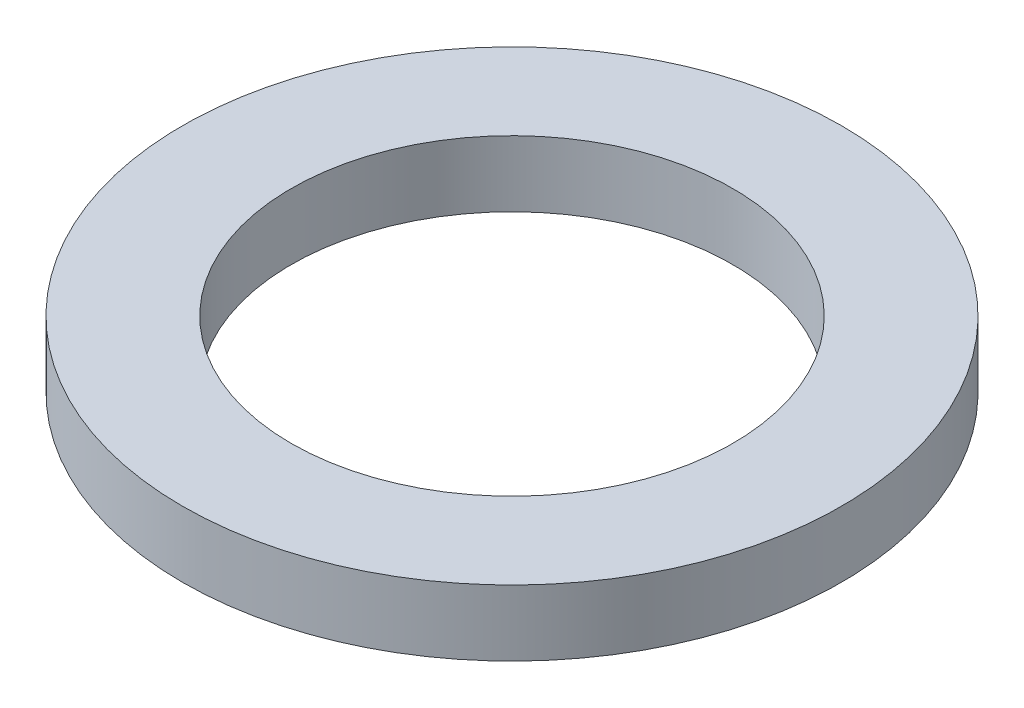
ISO-10303-21;
HEADER;
FILE_DESCRIPTION(('STEP AP214'),'2;1');
FILE_NAME('part.step','',(''),(''),'','','');
FILE_SCHEMA(('AUTOMOTIVE_DESIGN { 1 0 10303 214 1 1 1 1 }'));
ENDSEC;
DATA;
#1=APPLICATION_CONTEXT('core data for automotive mechanical design processes');
#2=APPLICATION_PROTOCOL_DEFINITION('international standard','automotive_design',2000,#1);
#3=PRODUCT_CONTEXT('',#1,'mechanical');
#4=PRODUCT('Part','Part','',(#3));
#5=PRODUCT_RELATED_PRODUCT_CATEGORY('part','',(#4));
#6=PRODUCT_DEFINITION_FORMATION('','',#4);
#7=PRODUCT_DEFINITION_CONTEXT('part definition',#1,'design');
#8=PRODUCT_DEFINITION('design','',#6,#7);
#9=PRODUCT_DEFINITION_SHAPE('','',#8);
#10=(LENGTH_UNIT() NAMED_UNIT(*) SI_UNIT(.MILLI.,.METRE.));
#11=(NAMED_UNIT(*) PLANE_ANGLE_UNIT() SI_UNIT($,.RADIAN.));
#12=(NAMED_UNIT(*) SI_UNIT($,.STERADIAN.) SOLID_ANGLE_UNIT());
#13=UNCERTAINTY_MEASURE_WITH_UNIT(LENGTH_MEASURE(1.E-05),#10,'distance_accuracy_value','');
#14=(GEOMETRIC_REPRESENTATION_CONTEXT(3) GLOBAL_UNCERTAINTY_ASSIGNED_CONTEXT((#13)) GLOBAL_UNIT_ASSIGNED_CONTEXT((#10,
#11,#12)) REPRESENTATION_CONTEXT('',''));
#15=CARTESIAN_POINT('',(0.,0.,0.));
#16=DIRECTION('',(0.,0.,1.));
#17=DIRECTION('',(1.,0.,0.));
#18=AXIS2_PLACEMENT_3D('',#15,#16,#17);
#19=CARTESIAN_POINT('',(0.,1.,0.));
#20=DIRECTION('',(0.,1.,0.));
#21=DIRECTION('',(0.,0.,1.));
#22=AXIS2_PLACEMENT_3D('',#19,#20,#21);
#23=PLANE('',#22);
#24=CARTESIAN_POINT('',(0.,1.,0.));
#25=DIRECTION('',(0.,1.,0.));
#26=DIRECTION('',(0.,0.,1.));
#27=AXIS2_PLACEMENT_3D('',#24,#25,#26);
#28=CIRCLE('',#27,5.);
#29=CARTESIAN_POINT('',(0.,1.,5.));
#30=VERTEX_POINT('',#29);
#31=EDGE_CURVE('E10',#30,#30,#28,.T.);
#32=ORIENTED_EDGE('',*,*,#31,.T.);
#33=EDGE_LOOP('',(#32));
#34=FACE_BOUND('',#33,.T.);
#35=CARTESIAN_POINT('',(0.,1.,0.));
#36=DIRECTION('',(0.,1.,0.));
#37=DIRECTION('',(0.,0.,1.));
#38=AXIS2_PLACEMENT_3D('',#35,#36,#37);
#39=CIRCLE('',#38,3.35);
#40=CARTESIAN_POINT('',(0.,1.,3.35));
#41=VERTEX_POINT('',#40);
#42=EDGE_CURVE('E43',#41,#41,#39,.T.);
#43=ORIENTED_EDGE('',*,*,#42,.F.);
#44=EDGE_LOOP('',(#43));
#45=FACE_BOUND('',#44,.T.);
#46=ADVANCED_FACE('F32',(#34,#45),#23,.T.);
#47=CARTESIAN_POINT('',(0.,0.,0.));
#48=DIRECTION('',(0.,1.,0.));
#49=DIRECTION('',(0.,0.,1.));
#50=AXIS2_PLACEMENT_3D('',#47,#48,#49);
#51=PLANE('',#50);
#52=CARTESIAN_POINT('',(0.,0.,0.));
#53=DIRECTION('',(0.,1.,0.));
#54=DIRECTION('',(0.,0.,1.));
#55=AXIS2_PLACEMENT_3D('',#52,#53,#54);
#56=CIRCLE('',#55,5.);
#57=CARTESIAN_POINT('',(0.,0.,5.));
#58=VERTEX_POINT('',#57);
#59=EDGE_CURVE('E36',#58,#58,#56,.T.);
#60=ORIENTED_EDGE('',*,*,#59,.F.);
#61=EDGE_LOOP('',(#60));
#62=FACE_BOUND('',#61,.T.);
#63=CARTESIAN_POINT('',(0.,0.,0.));
#64=DIRECTION('',(0.,1.,0.));
#65=DIRECTION('',(0.,0.,1.));
#66=AXIS2_PLACEMENT_3D('',#63,#64,#65);
#67=CIRCLE('',#66,3.35);
#68=CARTESIAN_POINT('',(0.,0.,3.35));
#69=VERTEX_POINT('',#68);
#70=EDGE_CURVE('E45',#69,#69,#67,.T.);
#71=ORIENTED_EDGE('',*,*,#70,.T.);
#72=EDGE_LOOP('',(#71));
#73=FACE_BOUND('',#72,.T.);
#74=ADVANCED_FACE('F55',(#62,#73),#51,.F.);
#75=CARTESIAN_POINT('',(0.,1.,0.));
#76=DIRECTION('',(0.,-1.,0.));
#77=DIRECTION('',(0.,0.,-1.));
#78=AXIS2_PLACEMENT_3D('',#75,#76,#77);
#79=CYLINDRICAL_SURFACE('',#78,5.);
#80=ORIENTED_EDGE('',*,*,#31,.F.);
#81=EDGE_LOOP('',(#80));
#82=FACE_BOUND('',#81,.T.);
#83=ORIENTED_EDGE('',*,*,#59,.T.);
#84=EDGE_LOOP('',(#83));
#85=FACE_BOUND('',#84,.T.);
#86=ADVANCED_FACE('F34',(#82,#85),#79,.T.);
#87=CARTESIAN_POINT('',(0.,1.,0.));
#88=DIRECTION('',(0.,-1.,0.));
#89=DIRECTION('',(0.,0.,-1.));
#90=AXIS2_PLACEMENT_3D('',#87,#88,#89);
#91=CYLINDRICAL_SURFACE('',#90,3.35);
#92=ORIENTED_EDGE('',*,*,#42,.T.);
#93=EDGE_LOOP('',(#92));
#94=FACE_BOUND('',#93,.T.);
#95=ORIENTED_EDGE('',*,*,#70,.F.);
#96=EDGE_LOOP('',(#95));
#97=FACE_BOUND('',#96,.T.);
#98=ADVANCED_FACE('F51',(#94,#97),#91,.F.);
#99=CLOSED_SHELL('',(#46,#74,#86,#98));
#100=MANIFOLD_SOLID_BREP('B2',#99);
#101=ADVANCED_BREP_SHAPE_REPRESENTATION('',(#18,#100),#14);
#102=SHAPE_DEFINITION_REPRESENTATION(#9,#101);
ENDSEC;
END-ISO-10303-21;
